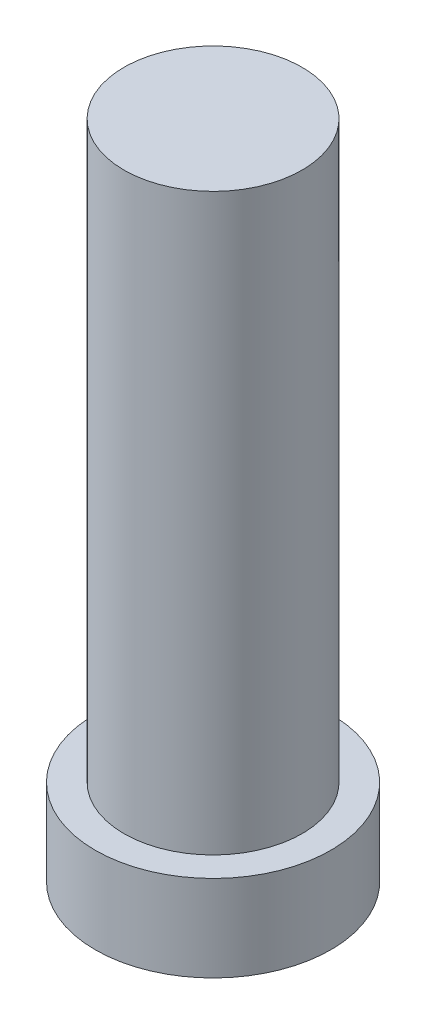
ISO-10303-21;
HEADER;
FILE_DESCRIPTION(('STEP AP214'),'2;1');
FILE_NAME('part.step','',(''),(''),'','','');
FILE_SCHEMA(('AUTOMOTIVE_DESIGN { 1 0 10303 214 1 1 1 1 }'));
ENDSEC;
DATA;
#1=APPLICATION_CONTEXT('core data for automotive mechanical design processes');
#2=APPLICATION_PROTOCOL_DEFINITION('international standard','automotive_design',2000,#1);
#3=PRODUCT_CONTEXT('',#1,'mechanical');
#4=PRODUCT('Part','Part','',(#3));
#5=PRODUCT_RELATED_PRODUCT_CATEGORY('part','',(#4));
#6=PRODUCT_DEFINITION_FORMATION('','',#4);
#7=PRODUCT_DEFINITION_CONTEXT('part definition',#1,'design');
#8=PRODUCT_DEFINITION('design','',#6,#7);
#9=PRODUCT_DEFINITION_SHAPE('','',#8);
#10=(LENGTH_UNIT() NAMED_UNIT(*) SI_UNIT(.MILLI.,.METRE.));
#11=(NAMED_UNIT(*) PLANE_ANGLE_UNIT() SI_UNIT($,.RADIAN.));
#12=(NAMED_UNIT(*) SI_UNIT($,.STERADIAN.) SOLID_ANGLE_UNIT());
#13=UNCERTAINTY_MEASURE_WITH_UNIT(LENGTH_MEASURE(1.E-05),#10,'distance_accuracy_value','');
#14=(GEOMETRIC_REPRESENTATION_CONTEXT(3) GLOBAL_UNCERTAINTY_ASSIGNED_CONTEXT((#13)) GLOBAL_UNIT_ASSIGNED_CONTEXT((#10,
#11,#12)) REPRESENTATION_CONTEXT('',''));
#15=CARTESIAN_POINT('',(0.,0.,0.));
#16=DIRECTION('',(0.,0.,1.));
#17=DIRECTION('',(1.,0.,0.));
#18=AXIS2_PLACEMENT_3D('',#15,#16,#17);
#19=CARTESIAN_POINT('',(0.,3.81,0.));
#20=DIRECTION('',(0.,-1.,0.));
#21=DIRECTION('',(0.,0.,-1.));
#22=AXIS2_PLACEMENT_3D('',#19,#20,#21);
#23=CYLINDRICAL_SURFACE('',#22,5.207);
#24=CARTESIAN_POINT('',(0.,3.81,0.));
#25=DIRECTION('',(0.,1.,0.));
#26=DIRECTION('',(0.,0.,1.));
#27=AXIS2_PLACEMENT_3D('',#24,#25,#26);
#28=CIRCLE('',#27,5.207);
#29=CARTESIAN_POINT('',(0.,3.81,5.207));
#30=VERTEX_POINT('',#29);
#31=EDGE_CURVE('E38',#30,#30,#28,.T.);
#32=ORIENTED_EDGE('',*,*,#31,.F.);
#33=EDGE_LOOP('',(#32));
#34=FACE_BOUND('',#33,.T.);
#35=CARTESIAN_POINT('',(0.,0.,0.));
#36=DIRECTION('',(0.,1.,0.));
#37=DIRECTION('',(0.,0.,1.));
#38=AXIS2_PLACEMENT_3D('',#35,#36,#37);
#39=CIRCLE('',#38,5.207);
#40=CARTESIAN_POINT('',(0.,0.,5.207));
#41=VERTEX_POINT('',#40);
#42=EDGE_CURVE('E34',#41,#41,#39,.T.);
#43=ORIENTED_EDGE('',*,*,#42,.T.);
#44=EDGE_LOOP('',(#43));
#45=FACE_BOUND('',#44,.T.);
#46=ADVANCED_FACE('F31',(#34,#45),#23,.T.);
#47=CARTESIAN_POINT('',(0.,3.81,0.));
#48=DIRECTION('',(0.,1.,0.));
#49=DIRECTION('',(0.,0.,1.));
#50=AXIS2_PLACEMENT_3D('',#47,#48,#49);
#51=PLANE('',#50);
#52=CARTESIAN_POINT('',(0.,3.81,0.));
#53=DIRECTION('',(0.,1.,0.));
#54=DIRECTION('',(0.,0.,1.));
#55=AXIS2_PLACEMENT_3D('',#52,#53,#54);
#56=CIRCLE('',#55,3.937);
#57=CARTESIAN_POINT('',(0.,3.81,3.937));
#58=VERTEX_POINT('',#57);
#59=EDGE_CURVE('E10',#58,#58,#56,.T.);
#60=ORIENTED_EDGE('',*,*,#59,.F.);
#61=EDGE_LOOP('',(#60));
#62=FACE_BOUND('',#61,.T.);
#63=ORIENTED_EDGE('',*,*,#31,.T.);
#64=EDGE_LOOP('',(#63));
#65=FACE_BOUND('',#64,.T.);
#66=ADVANCED_FACE('F55',(#62,#65),#51,.T.);
#67=CARTESIAN_POINT('',(0.,0.,0.));
#68=DIRECTION('',(0.,1.,0.));
#69=DIRECTION('',(0.,0.,1.));
#70=AXIS2_PLACEMENT_3D('',#67,#68,#69);
#71=PLANE('',#70);
#72=ORIENTED_EDGE('',*,*,#42,.F.);
#73=EDGE_LOOP('',(#72));
#74=FACE_BOUND('',#73,.T.);
#75=ADVANCED_FACE('F52',(#74),#71,.F.);
#76=CARTESIAN_POINT('',(0.,29.21,0.));
#77=DIRECTION('',(0.,-1.,0.));
#78=DIRECTION('',(0.,0.,-1.));
#79=AXIS2_PLACEMENT_3D('',#76,#77,#78);
#80=CYLINDRICAL_SURFACE('',#79,3.937);
#81=CARTESIAN_POINT('',(0.,29.21,0.));
#82=DIRECTION('',(0.,1.,0.));
#83=DIRECTION('',(0.,0.,1.));
#84=AXIS2_PLACEMENT_3D('',#81,#82,#83);
#85=CIRCLE('',#84,3.937);
#86=CARTESIAN_POINT('',(0.,29.21,3.937));
#87=VERTEX_POINT('',#86);
#88=EDGE_CURVE('E44',#87,#87,#85,.T.);
#89=ORIENTED_EDGE('',*,*,#88,.F.);
#90=EDGE_LOOP('',(#89));
#91=FACE_BOUND('',#90,.T.);
#92=ORIENTED_EDGE('',*,*,#59,.T.);
#93=EDGE_LOOP('',(#92));
#94=FACE_BOUND('',#93,.T.);
#95=ADVANCED_FACE('F54',(#91,#94),#80,.T.);
#96=CARTESIAN_POINT('',(0.,29.21,0.));
#97=DIRECTION('',(0.,1.,0.));
#98=DIRECTION('',(0.,0.,1.));
#99=AXIS2_PLACEMENT_3D('',#96,#97,#98);
#100=PLANE('',#99);
#101=ORIENTED_EDGE('',*,*,#88,.T.);
#102=EDGE_LOOP('',(#101));
#103=FACE_BOUND('',#102,.T.);
#104=ADVANCED_FACE('F60',(#103),#100,.T.);
#105=CLOSED_SHELL('',(#46,#66,#75,#95,#104));
#106=MANIFOLD_SOLID_BREP('B2',#105);
#107=ADVANCED_BREP_SHAPE_REPRESENTATION('',(#18,#106),#14);
#108=SHAPE_DEFINITION_REPRESENTATION(#9,#107);
ENDSEC;
END-ISO-10303-21;
